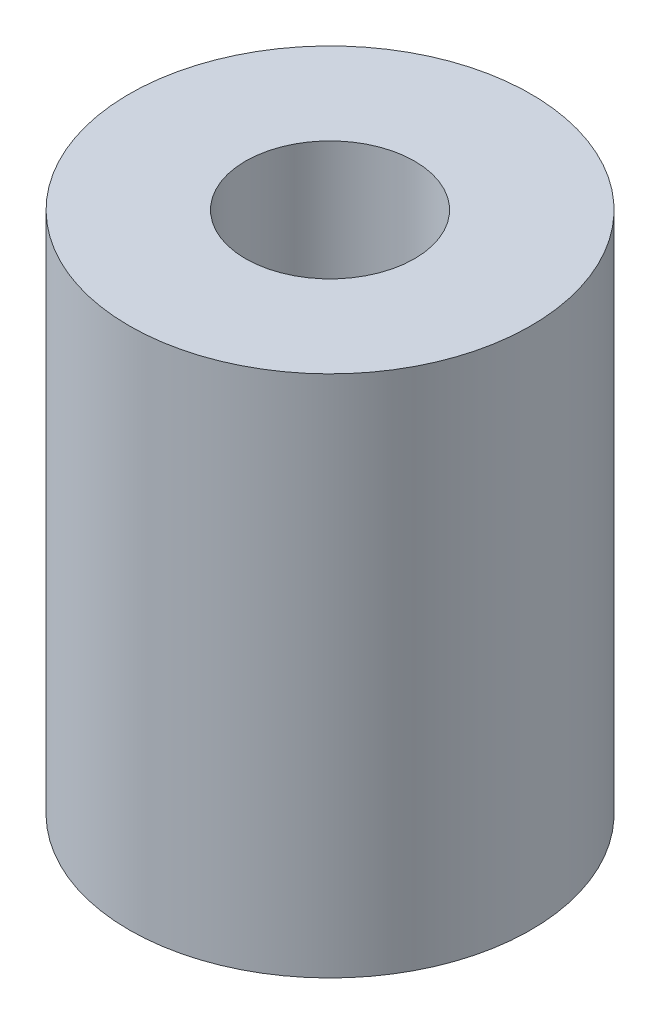
ISO-10303-21;
HEADER;
FILE_DESCRIPTION(('STEP AP214'),'2;1');
FILE_NAME('part.step','',(''),(''),'','','');
FILE_SCHEMA(('AUTOMOTIVE_DESIGN { 1 0 10303 214 1 1 1 1 }'));
ENDSEC;
DATA;
#1=APPLICATION_CONTEXT('core data for automotive mechanical design processes');
#2=APPLICATION_PROTOCOL_DEFINITION('international standard','automotive_design',2000,#1);
#3=PRODUCT_CONTEXT('',#1,'mechanical');
#4=PRODUCT('Part','Part','',(#3));
#5=PRODUCT_RELATED_PRODUCT_CATEGORY('part','',(#4));
#6=PRODUCT_DEFINITION_FORMATION('','',#4);
#7=PRODUCT_DEFINITION_CONTEXT('part definition',#1,'design');
#8=PRODUCT_DEFINITION('design','',#6,#7);
#9=PRODUCT_DEFINITION_SHAPE('','',#8);
#10=(LENGTH_UNIT() NAMED_UNIT(*) SI_UNIT(.MILLI.,.METRE.));
#11=(NAMED_UNIT(*) PLANE_ANGLE_UNIT() SI_UNIT($,.RADIAN.));
#12=(NAMED_UNIT(*) SI_UNIT($,.STERADIAN.) SOLID_ANGLE_UNIT());
#13=UNCERTAINTY_MEASURE_WITH_UNIT(LENGTH_MEASURE(1.E-05),#10,'distance_accuracy_value','');
#14=(GEOMETRIC_REPRESENTATION_CONTEXT(3) GLOBAL_UNCERTAINTY_ASSIGNED_CONTEXT((#13)) GLOBAL_UNIT_ASSIGNED_CONTEXT((#10,
#11,#12)) REPRESENTATION_CONTEXT('',''));
#15=CARTESIAN_POINT('',(0.,0.,0.));
#16=DIRECTION('',(0.,0.,1.));
#17=DIRECTION('',(1.,0.,0.));
#18=AXIS2_PLACEMENT_3D('',#15,#16,#17);
#19=CARTESIAN_POINT('',(0.,24.75,0.));
#20=DIRECTION('',(0.,1.,0.));
#21=DIRECTION('',(0.,0.,1.));
#22=AXIS2_PLACEMENT_3D('',#19,#20,#21);
#23=PLANE('',#22);
#24=CARTESIAN_POINT('',(0.,24.75,0.));
#25=DIRECTION('',(0.,1.,0.));
#26=DIRECTION('',(0.,0.,1.));
#27=AXIS2_PLACEMENT_3D('',#24,#25,#26);
#28=CIRCLE('',#27,9.50000000000001);
#29=CARTESIAN_POINT('',(0.,24.75,9.50000000000001));
#30=VERTEX_POINT('',#29);
#31=EDGE_CURVE('E10',#30,#30,#28,.T.);
#32=ORIENTED_EDGE('',*,*,#31,.T.);
#33=EDGE_LOOP('',(#32));
#34=FACE_BOUND('',#33,.T.);
#35=CARTESIAN_POINT('',(0.,24.75,0.));
#36=DIRECTION('',(0.,1.,0.));
#37=DIRECTION('',(0.,0.,1.));
#38=AXIS2_PLACEMENT_3D('',#35,#36,#37);
#39=CIRCLE('',#38,4.);
#40=CARTESIAN_POINT('',(0.,24.75,4.));
#41=VERTEX_POINT('',#40);
#42=EDGE_CURVE('E42',#41,#41,#39,.T.);
#43=ORIENTED_EDGE('',*,*,#42,.F.);
#44=EDGE_LOOP('',(#43));
#45=FACE_BOUND('',#44,.T.);
#46=ADVANCED_FACE('F31',(#34,#45),#23,.T.);
#47=CARTESIAN_POINT('',(0.,0.,0.));
#48=DIRECTION('',(0.,1.,0.));
#49=DIRECTION('',(0.,0.,1.));
#50=AXIS2_PLACEMENT_3D('',#47,#48,#49);
#51=PLANE('',#50);
#52=CARTESIAN_POINT('',(0.,0.,0.));
#53=DIRECTION('',(0.,1.,0.));
#54=DIRECTION('',(0.,0.,1.));
#55=AXIS2_PLACEMENT_3D('',#52,#53,#54);
#56=CIRCLE('',#55,9.50000000000001);
#57=CARTESIAN_POINT('',(0.,0.,9.50000000000001));
#58=VERTEX_POINT('',#57);
#59=EDGE_CURVE('E35',#58,#58,#56,.T.);
#60=ORIENTED_EDGE('',*,*,#59,.F.);
#61=EDGE_LOOP('',(#60));
#62=FACE_BOUND('',#61,.T.);
#63=CARTESIAN_POINT('',(0.,0.,0.));
#64=DIRECTION('',(0.,1.,0.));
#65=DIRECTION('',(0.,0.,1.));
#66=AXIS2_PLACEMENT_3D('',#63,#64,#65);
#67=CIRCLE('',#66,4.);
#68=CARTESIAN_POINT('',(0.,0.,4.));
#69=VERTEX_POINT('',#68);
#70=EDGE_CURVE('E44',#69,#69,#67,.T.);
#71=ORIENTED_EDGE('',*,*,#70,.T.);
#72=EDGE_LOOP('',(#71));
#73=FACE_BOUND('',#72,.T.);
#74=ADVANCED_FACE('F54',(#62,#73),#51,.F.);
#75=CARTESIAN_POINT('',(0.,24.75,0.));
#76=DIRECTION('',(0.,-1.,0.));
#77=DIRECTION('',(0.,0.,-1.));
#78=AXIS2_PLACEMENT_3D('',#75,#76,#77);
#79=CYLINDRICAL_SURFACE('',#78,9.50000000000001);
#80=ORIENTED_EDGE('',*,*,#31,.F.);
#81=EDGE_LOOP('',(#80));
#82=FACE_BOUND('',#81,.T.);
#83=ORIENTED_EDGE('',*,*,#59,.T.);
#84=EDGE_LOOP('',(#83));
#85=FACE_BOUND('',#84,.T.);
#86=ADVANCED_FACE('F33',(#82,#85),#79,.T.);
#87=CARTESIAN_POINT('',(0.,24.75,0.));
#88=DIRECTION('',(0.,-1.,0.));
#89=DIRECTION('',(0.,0.,-1.));
#90=AXIS2_PLACEMENT_3D('',#87,#88,#89);
#91=CYLINDRICAL_SURFACE('',#90,4.);
#92=ORIENTED_EDGE('',*,*,#42,.T.);
#93=EDGE_LOOP('',(#92));
#94=FACE_BOUND('',#93,.T.);
#95=ORIENTED_EDGE('',*,*,#70,.F.);
#96=EDGE_LOOP('',(#95));
#97=FACE_BOUND('',#96,.T.);
#98=ADVANCED_FACE('F50',(#94,#97),#91,.F.);
#99=CLOSED_SHELL('',(#46,#74,#86,#98));
#100=MANIFOLD_SOLID_BREP('B2',#99);
#101=ADVANCED_BREP_SHAPE_REPRESENTATION('',(#18,#100),#14);
#102=SHAPE_DEFINITION_REPRESENTATION(#9,#101);
ENDSEC;
END-ISO-10303-21;
